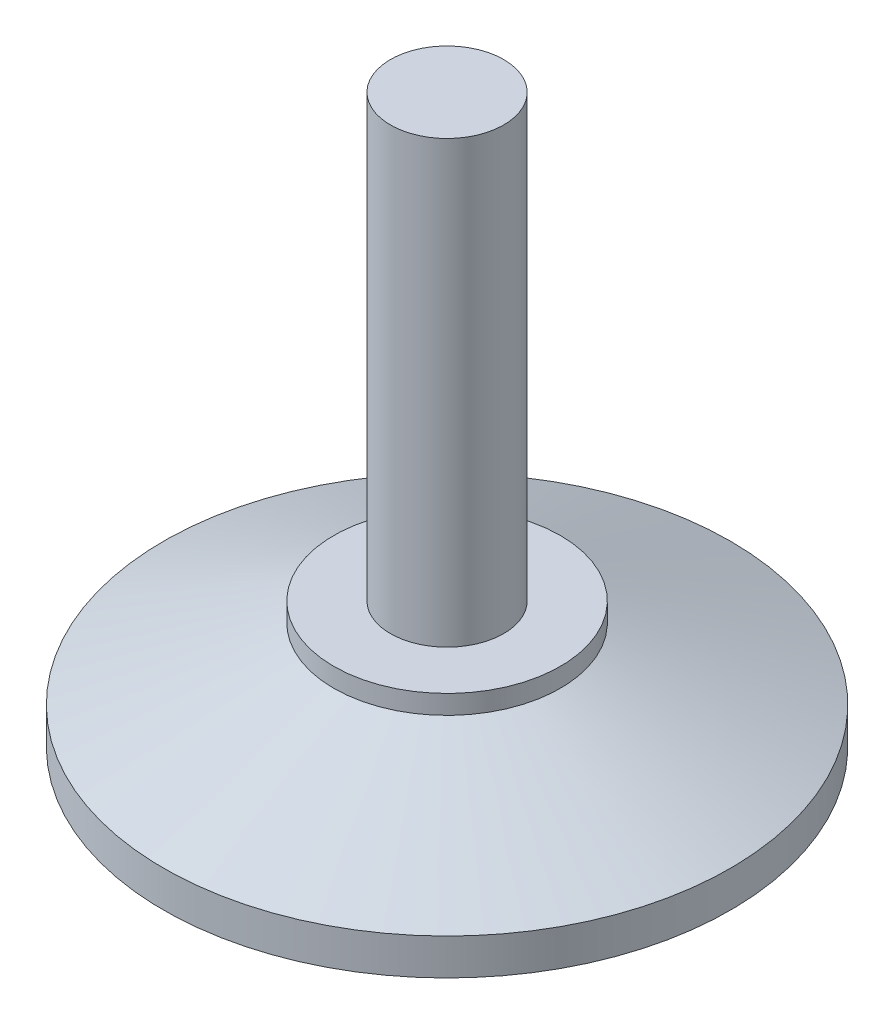
ISO-10303-21;
HEADER;
FILE_DESCRIPTION(('STEP AP214'),'2;1');
FILE_NAME('part.step','',(''),(''),'','','');
FILE_SCHEMA(('AUTOMOTIVE_DESIGN { 1 0 10303 214 1 1 1 1 }'));
ENDSEC;
DATA;
#1=APPLICATION_CONTEXT('core data for automotive mechanical design processes');
#2=APPLICATION_PROTOCOL_DEFINITION('international standard','automotive_design',2000,#1);
#3=PRODUCT_CONTEXT('',#1,'mechanical');
#4=PRODUCT('Part','Part','',(#3));
#5=PRODUCT_RELATED_PRODUCT_CATEGORY('part','',(#4));
#6=PRODUCT_DEFINITION_FORMATION('','',#4);
#7=PRODUCT_DEFINITION_CONTEXT('part definition',#1,'design');
#8=PRODUCT_DEFINITION('design','',#6,#7);
#9=PRODUCT_DEFINITION_SHAPE('','',#8);
#10=(LENGTH_UNIT() NAMED_UNIT(*) SI_UNIT(.MILLI.,.METRE.));
#11=(NAMED_UNIT(*) PLANE_ANGLE_UNIT() SI_UNIT($,.RADIAN.));
#12=(NAMED_UNIT(*) SI_UNIT($,.STERADIAN.) SOLID_ANGLE_UNIT());
#13=UNCERTAINTY_MEASURE_WITH_UNIT(LENGTH_MEASURE(1.E-05),#10,'distance_accuracy_value','');
#14=(GEOMETRIC_REPRESENTATION_CONTEXT(3) GLOBAL_UNCERTAINTY_ASSIGNED_CONTEXT((#13)) GLOBAL_UNIT_ASSIGNED_CONTEXT((#10,
#11,#12)) REPRESENTATION_CONTEXT('',''));
#15=CARTESIAN_POINT('',(0.,0.,0.));
#16=DIRECTION('',(0.,0.,1.));
#17=DIRECTION('',(1.,0.,0.));
#18=AXIS2_PLACEMENT_3D('',#15,#16,#17);
#19=CARTESIAN_POINT('',(0.,0.,0.));
#20=DIRECTION('',(0.,-1.,0.));
#21=DIRECTION('',(0.,0.,-1.));
#22=AXIS2_PLACEMENT_3D('',#19,#20,#21);
#23=CYLINDRICAL_SURFACE('',#22,12.);
#24=CARTESIAN_POINT('',(0.,11.3461546198198,0.));
#25=DIRECTION('',(0.,-1.,0.));
#26=DIRECTION('',(0.,0.,-1.));
#27=AXIS2_PLACEMENT_3D('',#24,#25,#26);
#28=CIRCLE('',#27,12.);
#29=CARTESIAN_POINT('',(0.,11.3461546198198,-12.));
#30=VERTEX_POINT('',#29);
#31=EDGE_CURVE('E57',#30,#30,#28,.T.);
#32=ORIENTED_EDGE('',*,*,#31,.F.);
#33=EDGE_LOOP('',(#32));
#34=FACE_BOUND('',#33,.T.);
#35=CARTESIAN_POINT('',(0.,13.3602583099196,0.));
#36=DIRECTION('',(0.,-1.,0.));
#37=DIRECTION('',(0.,0.,-1.));
#38=AXIS2_PLACEMENT_3D('',#35,#36,#37);
#39=CIRCLE('',#38,12.);
#40=CARTESIAN_POINT('',(0.,13.3602583099196,-12.));
#41=VERTEX_POINT('',#40);
#42=EDGE_CURVE('E10',#41,#41,#39,.T.);
#43=ORIENTED_EDGE('',*,*,#42,.T.);
#44=EDGE_LOOP('',(#43));
#45=FACE_BOUND('',#44,.T.);
#46=ADVANCED_FACE('F35',(#34,#45),#23,.T.);
#47=CARTESIAN_POINT('',(0.,13.3602583099196,0.));
#48=DIRECTION('',(0.,-1.,0.));
#49=DIRECTION('',(0.,0.,-1.));
#50=AXIS2_PLACEMENT_3D('',#47,#48,#49);
#51=PLANE('',#50);
#52=ORIENTED_EDGE('',*,*,#42,.F.);
#53=EDGE_LOOP('',(#52));
#54=FACE_BOUND('',#53,.T.);
#55=CARTESIAN_POINT('',(0.,13.3602583099196,0.));
#56=DIRECTION('',(0.,-1.,0.));
#57=DIRECTION('',(0.,0.,-1.));
#58=AXIS2_PLACEMENT_3D('',#55,#56,#57);
#59=CIRCLE('',#58,6.);
#60=CARTESIAN_POINT('',(0.,13.3602583099196,-6.));
#61=VERTEX_POINT('',#60);
#62=EDGE_CURVE('E41',#61,#61,#59,.T.);
#63=ORIENTED_EDGE('',*,*,#62,.T.);
#64=EDGE_LOOP('',(#63));
#65=FACE_BOUND('',#64,.T.);
#66=ADVANCED_FACE('F65',(#54,#65),#51,.F.);
#67=CARTESIAN_POINT('',(0.,0.,0.));
#68=DIRECTION('',(0.,-1.,0.));
#69=DIRECTION('',(0.,0.,-1.));
#70=AXIS2_PLACEMENT_3D('',#67,#68,#69);
#71=CYLINDRICAL_SURFACE('',#70,6.);
#72=CARTESIAN_POINT('',(0.,60.,0.));
#73=DIRECTION('',(0.,-1.,0.));
#74=DIRECTION('',(0.,0.,-1.));
#75=AXIS2_PLACEMENT_3D('',#72,#73,#74);
#76=CIRCLE('',#75,6.);
#77=CARTESIAN_POINT('',(0.,60.,-6.));
#78=VERTEX_POINT('',#77);
#79=EDGE_CURVE('E45',#78,#78,#76,.T.);
#80=ORIENTED_EDGE('',*,*,#79,.T.);
#81=EDGE_LOOP('',(#80));
#82=FACE_BOUND('',#81,.T.);
#83=ORIENTED_EDGE('',*,*,#62,.F.);
#84=EDGE_LOOP('',(#83));
#85=FACE_BOUND('',#84,.T.);
#86=ADVANCED_FACE('F69',(#82,#85),#71,.T.);
#87=CARTESIAN_POINT('',(0.,60.,0.));
#88=DIRECTION('',(0.,1.,0.));
#89=DIRECTION('',(0.,0.,1.));
#90=AXIS2_PLACEMENT_3D('',#87,#88,#89);
#91=PLANE('',#90);
#92=ORIENTED_EDGE('',*,*,#79,.F.);
#93=EDGE_LOOP('',(#92));
#94=FACE_BOUND('',#93,.T.);
#95=ADVANCED_FACE('F74',(#94),#91,.T.);
#96=CARTESIAN_POINT('',(0.,0.,0.));
#97=DIRECTION('',(0.,-1.,0.));
#98=DIRECTION('',(0.,0.,-1.));
#99=AXIS2_PLACEMENT_3D('',#96,#97,#98);
#100=PLANE('',#99);
#101=CARTESIAN_POINT('',(0.,0.,0.));
#102=DIRECTION('',(0.,-1.,0.));
#103=DIRECTION('',(0.,0.,-1.));
#104=AXIS2_PLACEMENT_3D('',#101,#102,#103);
#105=CIRCLE('',#104,30.);
#106=CARTESIAN_POINT('',(0.,0.,-30.));
#107=VERTEX_POINT('',#106);
#108=EDGE_CURVE('E49',#107,#107,#105,.T.);
#109=ORIENTED_EDGE('',*,*,#108,.T.);
#110=EDGE_LOOP('',(#109));
#111=FACE_BOUND('',#110,.T.);
#112=ADVANCED_FACE('F80',(#111),#100,.T.);
#113=CARTESIAN_POINT('',(0.,0.,0.));
#114=DIRECTION('',(0.,-1.,0.));
#115=DIRECTION('',(0.,0.,-1.));
#116=AXIS2_PLACEMENT_3D('',#113,#114,#115);
#117=CYLINDRICAL_SURFACE('',#116,30.);
#118=CARTESIAN_POINT('',(0.,3.84439781606716,0.));
#119=DIRECTION('',(0.,-1.,0.));
#120=DIRECTION('',(0.,0.,-1.));
#121=AXIS2_PLACEMENT_3D('',#118,#119,#120);
#122=CIRCLE('',#121,30.);
#123=CARTESIAN_POINT('',(0.,3.84439781606716,-30.));
#124=VERTEX_POINT('',#123);
#125=EDGE_CURVE('E54',#124,#124,#122,.T.);
#126=ORIENTED_EDGE('',*,*,#125,.T.);
#127=EDGE_LOOP('',(#126));
#128=FACE_BOUND('',#127,.T.);
#129=ORIENTED_EDGE('',*,*,#108,.F.);
#130=EDGE_LOOP('',(#129));
#131=FACE_BOUND('',#130,.T.);
#132=ADVANCED_FACE('F84',(#128,#131),#117,.T.);
#133=CARTESIAN_POINT('',(0.,3.84439781606716,0.));
#134=DIRECTION('',(0.,-1.,0.));
#135=DIRECTION('',(0.,0.,-1.));
#136=AXIS2_PLACEMENT_3D('',#133,#134,#135);
#137=CONICAL_SURFACE('',#136,30.,1.17592204766906);
#138=ORIENTED_EDGE('',*,*,#31,.T.);
#139=EDGE_LOOP('',(#138));
#140=FACE_BOUND('',#139,.T.);
#141=ORIENTED_EDGE('',*,*,#125,.F.);
#142=EDGE_LOOP('',(#141));
#143=FACE_BOUND('',#142,.T.);
#144=ADVANCED_FACE('F61',(#140,#143),#137,.T.);
#145=CLOSED_SHELL('',(#46,#66,#86,#95,#112,#132,#144));
#146=MANIFOLD_SOLID_BREP('B2',#145);
#147=ADVANCED_BREP_SHAPE_REPRESENTATION('',(#18,#146),#14);
#148=SHAPE_DEFINITION_REPRESENTATION(#9,#147);
ENDSEC;
END-ISO-10303-21;
